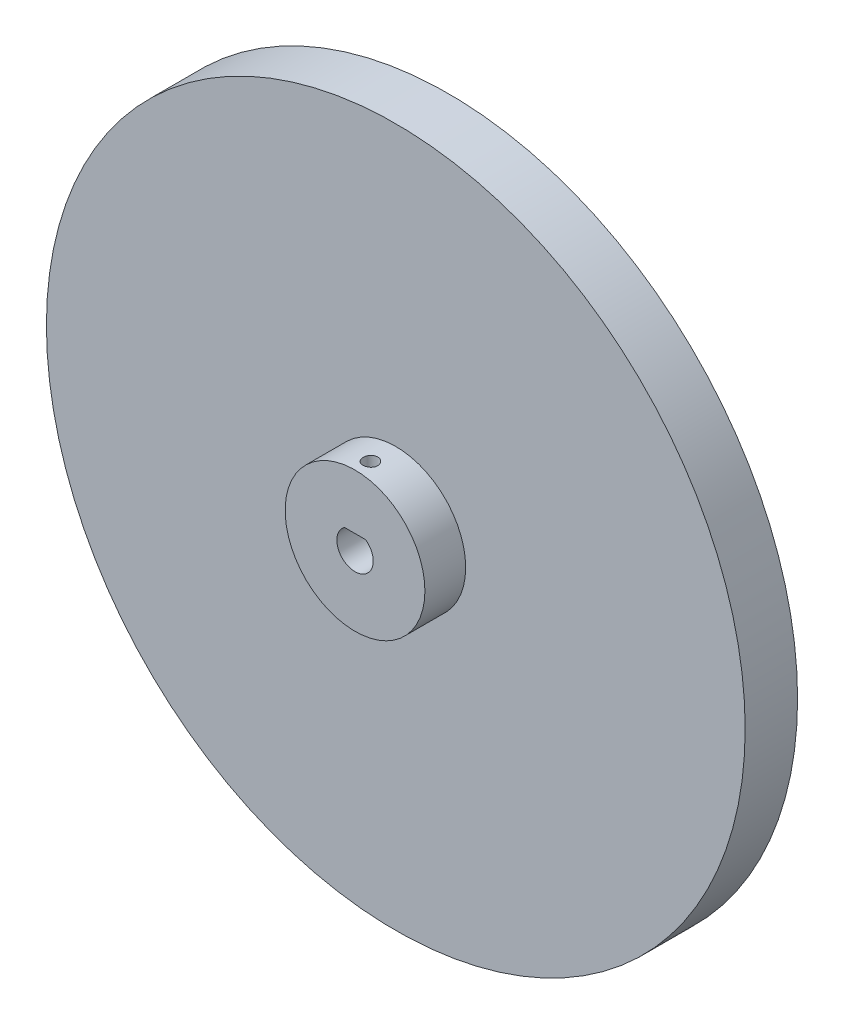
ISO-10303-21;
HEADER;
FILE_DESCRIPTION(('STEP AP214'),'2;1');
FILE_NAME('part.step','',(''),(''),'','','');
FILE_SCHEMA(('AUTOMOTIVE_DESIGN { 1 0 10303 214 1 1 1 1 }'));
ENDSEC;
DATA;
#1=APPLICATION_CONTEXT('core data for automotive mechanical design processes');
#2=APPLICATION_PROTOCOL_DEFINITION('international standard','automotive_design',2000,#1);
#3=PRODUCT_CONTEXT('',#1,'mechanical');
#4=PRODUCT('Part','Part','',(#3));
#5=PRODUCT_RELATED_PRODUCT_CATEGORY('part','',(#4));
#6=PRODUCT_DEFINITION_FORMATION('','',#4);
#7=PRODUCT_DEFINITION_CONTEXT('part definition',#1,'design');
#8=PRODUCT_DEFINITION('design','',#6,#7);
#9=PRODUCT_DEFINITION_SHAPE('','',#8);
#10=(LENGTH_UNIT() NAMED_UNIT(*) SI_UNIT(.MILLI.,.METRE.));
#11=(NAMED_UNIT(*) PLANE_ANGLE_UNIT() SI_UNIT($,.RADIAN.));
#12=(NAMED_UNIT(*) SI_UNIT($,.STERADIAN.) SOLID_ANGLE_UNIT());
#13=UNCERTAINTY_MEASURE_WITH_UNIT(LENGTH_MEASURE(1.E-05),#10,'distance_accuracy_value','');
#14=(GEOMETRIC_REPRESENTATION_CONTEXT(3) GLOBAL_UNCERTAINTY_ASSIGNED_CONTEXT((#13)) GLOBAL_UNIT_ASSIGNED_CONTEXT((#10,
#11,#12)) REPRESENTATION_CONTEXT('',''));
#15=CARTESIAN_POINT('',(0.,0.,0.));
#16=DIRECTION('',(0.,0.,1.));
#17=DIRECTION('',(1.,0.,0.));
#18=AXIS2_PLACEMENT_3D('',#15,#16,#17);
#19=CARTESIAN_POINT('',(0.,0.,9.));
#20=DIRECTION('',(0.,0.,1.));
#21=DIRECTION('',(1.,0.,0.));
#22=AXIS2_PLACEMENT_3D('',#19,#20,#21);
#23=PLANE('',#22);
#24=CARTESIAN_POINT('',(0.,0.,9.));
#25=DIRECTION('',(0.,0.,1.));
#26=DIRECTION('',(1.,0.,0.));
#27=AXIS2_PLACEMENT_3D('',#24,#25,#26);
#28=CIRCLE('',#27,60.);
#29=CARTESIAN_POINT('',(60.,0.,9.));
#30=VERTEX_POINT('',#29);
#31=EDGE_CURVE('E11',#30,#30,#28,.T.);
#32=ORIENTED_EDGE('',*,*,#31,.T.);
#33=EDGE_LOOP('',(#32));
#34=FACE_BOUND('',#33,.T.);
#35=CARTESIAN_POINT('',(0.,0.,9.));
#36=DIRECTION('',(0.,0.,1.));
#37=DIRECTION('',(1.,0.,0.));
#38=AXIS2_PLACEMENT_3D('',#35,#36,#37);
#39=CIRCLE('',#38,12.);
#40=CARTESIAN_POINT('',(12.,0.,9.));
#41=VERTEX_POINT('',#40);
#42=EDGE_CURVE('E77',#41,#41,#39,.T.);
#43=ORIENTED_EDGE('',*,*,#42,.F.);
#44=EDGE_LOOP('',(#43));
#45=FACE_BOUND('',#44,.T.);
#46=ADVANCED_FACE('F33',(#34,#45),#23,.T.);
#47=CARTESIAN_POINT('',(0.,0.,0.));
#48=DIRECTION('',(0.,0.,1.));
#49=DIRECTION('',(1.,0.,0.));
#50=AXIS2_PLACEMENT_3D('',#47,#48,#49);
#51=PLANE('',#50);
#52=CARTESIAN_POINT('',(0.,0.,0.));
#53=DIRECTION('',(0.,0.,1.));
#54=DIRECTION('',(1.,0.,0.));
#55=AXIS2_PLACEMENT_3D('',#52,#53,#54);
#56=CIRCLE('',#55,60.);
#57=CARTESIAN_POINT('',(60.,0.,0.));
#58=VERTEX_POINT('',#57);
#59=EDGE_CURVE('E46',#58,#58,#56,.T.);
#60=ORIENTED_EDGE('',*,*,#59,.F.);
#61=EDGE_LOOP('',(#60));
#62=FACE_BOUND('',#61,.T.);
#63=CARTESIAN_POINT('',(0.,0.,0.));
#64=DIRECTION('',(0.,0.,1.));
#65=DIRECTION('',(1.,0.,0.));
#66=AXIS2_PLACEMENT_3D('',#63,#64,#65);
#67=CIRCLE('',#66,3.125);
#68=CARTESIAN_POINT('',(-1.80641218995001,2.55,0.));
#69=VERTEX_POINT('',#68);
#70=CARTESIAN_POINT('',(1.80641218995001,2.55,0.));
#71=VERTEX_POINT('',#70);
#72=EDGE_CURVE('E54',#69,#71,#67,.T.);
#73=ORIENTED_EDGE('',*,*,#72,.T.);
#74=DIRECTION('',(-1.,0.,0.));
#75=VECTOR('',#74,1.);
#76=CARTESIAN_POINT('',(-1.80641218995001,2.55,0.));
#77=LINE('',#76,#75);
#78=EDGE_CURVE('E61',#71,#69,#77,.T.);
#79=ORIENTED_EDGE('',*,*,#78,.T.);
#80=EDGE_LOOP('',(#73,#79));
#81=FACE_BOUND('',#80,.T.);
#82=ADVANCED_FACE('F96',(#62,#81),#51,.F.);
#83=CARTESIAN_POINT('',(0.,0.,9.));
#84=DIRECTION('',(0.,0.,-1.));
#85=DIRECTION('',(-1.,0.,0.));
#86=AXIS2_PLACEMENT_3D('',#83,#84,#85);
#87=CYLINDRICAL_SURFACE('',#86,60.);
#88=ORIENTED_EDGE('',*,*,#31,.F.);
#89=EDGE_LOOP('',(#88));
#90=FACE_BOUND('',#89,.T.);
#91=ORIENTED_EDGE('',*,*,#59,.T.);
#92=EDGE_LOOP('',(#91));
#93=FACE_BOUND('',#92,.T.);
#94=ADVANCED_FACE('F35',(#90,#93),#87,.T.);
#95=CARTESIAN_POINT('',(0.,0.,9.));
#96=DIRECTION('',(0.,0.,-1.));
#97=DIRECTION('',(-1.,0.,0.));
#98=AXIS2_PLACEMENT_3D('',#95,#96,#97);
#99=CYLINDRICAL_SURFACE('',#98,3.125);
#100=ORIENTED_EDGE('',*,*,#72,.F.);
#101=DIRECTION('',(0.,0.,-1.));
#102=VECTOR('',#101,1.);
#103=CARTESIAN_POINT('',(-1.80641218995001,2.55,9.));
#104=LINE('',#103,#102);
#105=CARTESIAN_POINT('',(-1.80641218995001,2.55,16.));
#106=VERTEX_POINT('',#105);
#107=EDGE_CURVE('E66',#106,#69,#104,.T.);
#108=ORIENTED_EDGE('',*,*,#107,.F.);
#109=CARTESIAN_POINT('',(0.,0.,16.));
#110=DIRECTION('',(0.,0.,1.));
#111=DIRECTION('',(1.,0.,0.));
#112=AXIS2_PLACEMENT_3D('',#109,#110,#111);
#113=CIRCLE('',#112,3.125);
#114=CARTESIAN_POINT('',(1.80641218995001,2.55,16.));
#115=VERTEX_POINT('',#114);
#116=EDGE_CURVE('E70',#106,#115,#113,.T.);
#117=ORIENTED_EDGE('',*,*,#116,.T.);
#118=DIRECTION('',(0.,0.,-1.));
#119=VECTOR('',#118,1.);
#120=CARTESIAN_POINT('',(1.80641218995001,2.55,9.));
#121=LINE('',#120,#119);
#122=EDGE_CURVE('E72',#115,#71,#121,.T.);
#123=ORIENTED_EDGE('',*,*,#122,.T.);
#124=EDGE_LOOP('',(#100,#108,#117,#123));
#125=FACE_BOUND('',#124,.T.);
#126=ADVANCED_FACE('F68',(#125),#99,.F.);
#127=CARTESIAN_POINT('',(-1.80641218995001,2.55,9.));
#128=DIRECTION('',(0.,-1.,0.));
#129=DIRECTION('',(0.,0.,-1.));
#130=AXIS2_PLACEMENT_3D('',#127,#128,#129);
#131=PLANE('',#130);
#132=CARTESIAN_POINT('',(0.,2.55,13.363805145076));
#133=DIRECTION('',(0.,-1.,0.));
#134=DIRECTION('',(0.,0.,-1.));
#135=AXIS2_PLACEMENT_3D('',#132,#133,#134);
#136=CIRCLE('',#135,1.25);
#137=CARTESIAN_POINT('',(0.,2.55,12.113805145076));
#138=VERTEX_POINT('',#137);
#139=EDGE_CURVE('E82',#138,#138,#136,.T.);
#140=ORIENTED_EDGE('',*,*,#139,.F.);
#141=EDGE_LOOP('',(#140));
#142=FACE_BOUND('',#141,.T.);
#143=ORIENTED_EDGE('',*,*,#78,.F.);
#144=ORIENTED_EDGE('',*,*,#122,.F.);
#145=DIRECTION('',(-1.,0.,0.));
#146=VECTOR('',#145,1.);
#147=CARTESIAN_POINT('',(-1.80641218995001,2.55,16.));
#148=LINE('',#147,#146);
#149=EDGE_CURVE('E74',#115,#106,#148,.T.);
#150=ORIENTED_EDGE('',*,*,#149,.T.);
#151=ORIENTED_EDGE('',*,*,#107,.T.);
#152=EDGE_LOOP('',(#143,#144,#150,#151));
#153=FACE_BOUND('',#152,.T.);
#154=ADVANCED_FACE('F75',(#142,#153),#131,.T.);
#155=CARTESIAN_POINT('',(0.,0.,16.));
#156=DIRECTION('',(0.,0.,1.));
#157=DIRECTION('',(1.,0.,0.));
#158=AXIS2_PLACEMENT_3D('',#155,#156,#157);
#159=PLANE('',#158);
#160=CARTESIAN_POINT('',(0.,0.,16.));
#161=DIRECTION('',(0.,0.,1.));
#162=DIRECTION('',(1.,0.,0.));
#163=AXIS2_PLACEMENT_3D('',#160,#161,#162);
#164=CIRCLE('',#163,12.);
#165=CARTESIAN_POINT('',(12.,0.,16.));
#166=VERTEX_POINT('',#165);
#167=EDGE_CURVE('E85',#166,#166,#164,.T.);
#168=ORIENTED_EDGE('',*,*,#167,.T.);
#169=EDGE_LOOP('',(#168));
#170=FACE_BOUND('',#169,.T.);
#171=ORIENTED_EDGE('',*,*,#149,.F.);
#172=ORIENTED_EDGE('',*,*,#116,.F.);
#173=EDGE_LOOP('',(#171,#172));
#174=FACE_BOUND('',#173,.T.);
#175=ADVANCED_FACE('F79',(#170,#174),#159,.T.);
#176=CARTESIAN_POINT('',(0.,0.,16.));
#177=DIRECTION('',(0.,0.,-1.));
#178=DIRECTION('',(-1.,0.,0.));
#179=AXIS2_PLACEMENT_3D('',#176,#177,#178);
#180=CYLINDRICAL_SURFACE('',#179,12.);
#181=CARTESIAN_POINT('',(0.,12.,12.113805145076));
#182=CARTESIAN_POINT('',(0.0700095494879672,11.9999991642872,12.1138081688562));
#183=CARTESIAN_POINT('',(0.140065002410054,11.9993808287118,12.1197065562687));
#184=CARTESIAN_POINT('',(0.278232608485379,11.9969736264618,12.1431467223989));
#185=CARTESIAN_POINT('',(0.346342552614999,11.9951834804073,12.160701227538));
#186=CARTESIAN_POINT('',(0.478598413117925,11.9906346712346,12.2069360951419));
#187=CARTESIAN_POINT('',(0.542746737320355,11.9878766033589,12.2356096208808));
#188=CARTESIAN_POINT('',(0.66530650391253,11.9817001005453,12.3032550545076));
#189=CARTESIAN_POINT('',(0.723719060185856,11.9782817942095,12.3422249573968));
#190=CARTESIAN_POINT('',(0.833390013644795,11.9711526751922,12.4295194404374));
#191=CARTESIAN_POINT('',(0.884622960494008,11.9674408914449,12.4778759184203));
#192=CARTESIAN_POINT('',(0.978261562000662,11.9601511575164,12.5825027573861));
#193=CARTESIAN_POINT('',(1.02066680237567,11.9565732136228,12.6387734895756));
#194=CARTESIAN_POINT('',(1.09553719669395,11.9499464131795,12.7577918504251));
#195=CARTESIAN_POINT('',(1.12797918293743,11.9468987968275,12.8205541280728));
#196=CARTESIAN_POINT('',(1.18185422718569,11.9416898936638,12.9506725478863));
#197=CARTESIAN_POINT('',(1.20328757896304,11.9395285832006,13.0180285674107));
#198=CARTESIAN_POINT('',(1.23446116549206,11.9363458728961,13.1551620937826));
#199=CARTESIAN_POINT('',(1.24424374803227,11.9353203457101,13.2249298766024));
#200=CARTESIAN_POINT('',(1.25196903004635,11.9345125354877,13.3651240012249));
#201=CARTESIAN_POINT('',(1.24991206557194,11.9347302171641,13.435550324279));
#202=CARTESIAN_POINT('',(1.23405152506975,11.9363804586047,13.5747699846615));
#203=CARTESIAN_POINT('',(1.22029424848266,11.9378082298324,13.6435686613877));
#204=CARTESIAN_POINT('',(1.1814956731824,11.9417102992231,13.7778753063804));
#205=CARTESIAN_POINT('',(1.1564542103875,11.9441846126035,13.8433832267811));
#206=CARTESIAN_POINT('',(1.09574719612483,11.9499064730575,13.9693947201374));
#207=CARTESIAN_POINT('',(1.06006116722708,11.953155508059,14.0298883576218));
#208=CARTESIAN_POINT('',(0.979092720135939,11.9600594875767,14.1440453485312));
#209=CARTESIAN_POINT('',(0.933809997063839,11.9637144449871,14.1977084848703));
#210=CARTESIAN_POINT('',(0.834675280938104,11.9710397802306,14.2969501723986));
#211=CARTESIAN_POINT('',(0.780783314157841,11.97471014815,14.3424888032178));
#212=CARTESIAN_POINT('',(0.666098532189394,11.9816362536886,14.4238791779585));
#213=CARTESIAN_POINT('',(0.60530570822991,11.9848919907809,14.4597309095672));
#214=CARTESIAN_POINT('',(0.478516764921767,11.9906232037876,14.5207284316301));
#215=CARTESIAN_POINT('',(0.412519629297687,11.9930985268321,14.5458721248988));
#216=CARTESIAN_POINT('',(0.277208837646706,11.9969884809875,14.5847102087673));
#217=CARTESIAN_POINT('',(0.207895289340299,11.9984031465247,14.5984049709736));
#218=CARTESIAN_POINT('',(0.0682648586938698,12.0000079610362,14.6139056389609));
#219=CARTESIAN_POINT('',(-0.0020458474164613,12.0002037822377,14.6157666173858));
#220=CARTESIAN_POINT('',(-0.141978142720368,11.9993640699192,14.6076916429495));
#221=CARTESIAN_POINT('',(-0.211599742015272,11.9983285544758,14.597755863271));
#222=CARTESIAN_POINT('',(-0.348018029476928,11.995146140952,14.566415112254));
#223=CARTESIAN_POINT('',(-0.414820721686737,11.9930017489258,14.5450359989705));
#224=CARTESIAN_POINT('',(-0.54389172382628,11.98784207376,14.4914420757965));
#225=CARTESIAN_POINT('',(-0.606159923902425,11.9848267695301,14.4592270034978));
#226=CARTESIAN_POINT('',(-0.72464291900231,11.9782482392504,14.384739555756));
#227=CARTESIAN_POINT('',(-0.780834909391518,11.9746830631459,14.3424310812862));
#228=CARTESIAN_POINT('',(-0.885339382882751,11.9674108977167,14.2490094660989));
#229=CARTESIAN_POINT('',(-0.933651650991106,11.9637039045259,14.1978960852229));
#230=CARTESIAN_POINT('',(-1.02121712756248,11.9565487724948,14.0880749243855));
#231=CARTESIAN_POINT('',(-1.06043413579885,11.9531017036895,14.0293382007215));
#232=CARTESIAN_POINT('',(-1.12844682402802,11.9468731948153,13.9060800806749));
#233=CARTESIAN_POINT('',(-1.15724265694647,11.9440917449791,13.8415587691955));
#234=CARTESIAN_POINT('',(-1.2035352838692,11.9395161797365,13.708686028232));
#235=CARTESIAN_POINT('',(-1.22105344529625,11.9377201981564,13.64034211006));
#236=CARTESIAN_POINT('',(-1.24436270906374,11.9353131909021,13.5016631436743));
#237=CARTESIAN_POINT('',(-1.25015417898762,11.9347021280856,13.4313281579425));
#238=CARTESIAN_POINT('',(-1.24984031256419,11.9347349734758,13.291023454865));
#239=CARTESIAN_POINT('',(-1.24379184136804,11.9353728830911,13.2210536019781));
#240=CARTESIAN_POINT('',(-1.22008919679213,11.9378189905869,13.0831299178873));
#241=CARTESIAN_POINT('',(-1.20243501187647,11.9396271896308,13.0151760886874));
#242=CARTESIAN_POINT('',(-1.15603809633997,11.9442084445198,12.8832149313827));
#243=CARTESIAN_POINT('',(-1.12729720150595,11.9469813406187,12.8192069519407));
#244=CARTESIAN_POINT('',(-1.05954851165036,11.9531798687626,12.6969142433988));
#245=CARTESIAN_POINT('',(-1.02054074557837,11.9566054989672,12.6386294981617));
#246=CARTESIAN_POINT('',(-0.933152337738087,11.9637432302473,12.5291463644347));
#247=CARTESIAN_POINT('',(-0.884729299095298,11.9674565796301,12.4779818970299));
#248=CARTESIAN_POINT('',(-0.779969862539384,11.9747399925001,12.3844804898145));
#249=CARTESIAN_POINT('',(-0.723631576825858,11.9783100215432,12.3421456618905));
#250=CARTESIAN_POINT('',(-0.604472478145271,11.9849147120146,12.2674137164188));
#251=CARTESIAN_POINT('',(-0.541634534666211,11.9879478984777,12.2350438024929));
#252=CARTESIAN_POINT('',(-0.411422843814935,11.9931213369361,12.1813586537672));
#253=CARTESIAN_POINT('',(-0.344054279006827,11.9952625896922,12.1600310228217));
#254=CARTESIAN_POINT('',(-0.230257563143005,11.9978761527569,12.134321962616));
#255=CARTESIAN_POINT('',(-0.184555489720073,11.998668856663,12.1266387495841));
#256=CARTESIAN_POINT('',(-0.0925756340610833,11.999731055421,12.1163793526561));
#257=CARTESIAN_POINT('',(-0.0462978544563026,12.0000005526633,12.1138031454268));
#258=CARTESIAN_POINT('',(0.,12.,12.113805145076));
#259=B_SPLINE_CURVE_WITH_KNOTS('',3,(#181,#182,#183,#184,#185,#186,#187,#188,#189,#190,#191,
#192,#193,#194,#195,#196,#197,#198,#199,#200,#201,#202,#203,#204,#205,#206,#207,#208,#209,#210,
#211,#212,#213,#214,#215,#216,#217,#218,#219,#220,#221,#222,#223,#224,#225,#226,#227,#228,#229,
#230,#231,#232,#233,#234,#235,#236,#237,#238,#239,#240,#241,#242,#243,#244,#245,#246,#247,#248,
#249,#250,#251,#252,#253,#254,#255,#256,#257,#258),.UNSPECIFIED.,.T.,.F.,(4,2,2,2,2,2,2,2,2,2,2,
2,2,2,2,2,2,2,2,2,2,2,2,2,2,2,2,2,2,2,2,2,2,2,2,2,2,2,4),(0.,0.209859578808885,
0.419948664798438,0.62990877811076,0.839828036286579,1.05047354994535,1.26112894692693,
1.47227053850523,1.68340649534035,1.89377265772064,2.1041328491326,2.3136644742687,
2.52319914627208,2.73313953815067,2.94308660065497,3.15403842947493,3.36499052642715,
3.57598391968831,3.78697046431325,3.99697438635691,4.20697522546866,4.41650352486908,
4.62603689865995,4.83633120945248,5.04663125704429,5.25775448481459,5.46887461432945,
5.67959355518837,5.89030589077468,6.10000869487958,6.30971170742628,6.51938001130895,
6.72904772399435,6.93968239830693,7.15036739491246,7.36162255036676,7.57264003223294,
7.71142242261125,7.85020417891472),.UNSPECIFIED.);
#260=CARTESIAN_POINT('',(0.,12.,12.113805145076));
#261=VERTEX_POINT('',#260);
#262=EDGE_CURVE('E37',#261,#261,#259,.T.);
#263=ORIENTED_EDGE('',*,*,#262,.T.);
#264=EDGE_LOOP('',(#263));
#265=FACE_BOUND('',#264,.T.);
#266=ORIENTED_EDGE('',*,*,#167,.F.);
#267=EDGE_LOOP('',(#266));
#268=FACE_BOUND('',#267,.T.);
#269=ORIENTED_EDGE('',*,*,#42,.T.);
#270=EDGE_LOOP('',(#269));
#271=FACE_BOUND('',#270,.T.);
#272=ADVANCED_FACE('F111',(#265,#268,#271),#180,.T.);
#273=CARTESIAN_POINT('',(0.,12.55,13.363805145076));
#274=DIRECTION('',(0.,-1.,0.));
#275=DIRECTION('',(0.,0.,-1.));
#276=AXIS2_PLACEMENT_3D('',#273,#274,#275);
#277=CYLINDRICAL_SURFACE('',#276,1.25);
#278=ORIENTED_EDGE('',*,*,#139,.T.);
#279=EDGE_LOOP('',(#278));
#280=FACE_BOUND('',#279,.T.);
#281=ORIENTED_EDGE('',*,*,#262,.F.);
#282=EDGE_LOOP('',(#281));
#283=FACE_BOUND('',#282,.T.);
#284=ADVANCED_FACE('F115',(#280,#283),#277,.F.);
#285=CLOSED_SHELL('',(#46,#82,#94,#126,#154,#175,#272,#284));
#286=MANIFOLD_SOLID_BREP('B2',#285);
#287=ADVANCED_BREP_SHAPE_REPRESENTATION('',(#18,#286),#14);
#288=SHAPE_DEFINITION_REPRESENTATION(#9,#287);
ENDSEC;
END-ISO-10303-21;
